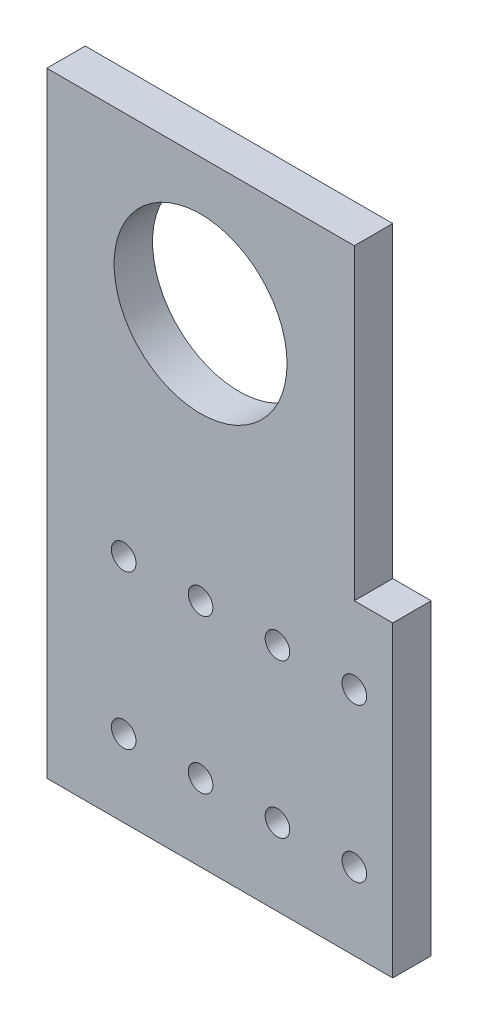
ISO-10303-21;
HEADER;
FILE_DESCRIPTION(('STEP AP214'),'2;1');
FILE_NAME('part.step','',(''),(''),'','','');
FILE_SCHEMA(('AUTOMOTIVE_DESIGN { 1 0 10303 214 1 1 1 1 }'));
ENDSEC;
DATA;
#1=APPLICATION_CONTEXT('core data for automotive mechanical design processes');
#2=APPLICATION_PROTOCOL_DEFINITION('international standard','automotive_design',2000,#1);
#3=PRODUCT_CONTEXT('',#1,'mechanical');
#4=PRODUCT('Part','Part','',(#3));
#5=PRODUCT_RELATED_PRODUCT_CATEGORY('part','',(#4));
#6=PRODUCT_DEFINITION_FORMATION('','',#4);
#7=PRODUCT_DEFINITION_CONTEXT('part definition',#1,'design');
#8=PRODUCT_DEFINITION('design','',#6,#7);
#9=PRODUCT_DEFINITION_SHAPE('','',#8);
#10=(LENGTH_UNIT() NAMED_UNIT(*) SI_UNIT(.MILLI.,.METRE.));
#11=(NAMED_UNIT(*) PLANE_ANGLE_UNIT() SI_UNIT($,.RADIAN.));
#12=(NAMED_UNIT(*) SI_UNIT($,.STERADIAN.) SOLID_ANGLE_UNIT());
#13=UNCERTAINTY_MEASURE_WITH_UNIT(LENGTH_MEASURE(1.E-05),#10,'distance_accuracy_value','');
#14=(GEOMETRIC_REPRESENTATION_CONTEXT(3) GLOBAL_UNCERTAINTY_ASSIGNED_CONTEXT((#13)) GLOBAL_UNIT_ASSIGNED_CONTEXT((#10,
#11,#12)) REPRESENTATION_CONTEXT('',''));
#15=CARTESIAN_POINT('',(0.,0.,0.));
#16=DIRECTION('',(0.,0.,1.));
#17=DIRECTION('',(1.,0.,0.));
#18=AXIS2_PLACEMENT_3D('',#15,#16,#17);
#19=CARTESIAN_POINT('',(-125.79203122036,-159.641560720638,6.35));
#20=DIRECTION('',(1.,0.,0.));
#21=DIRECTION('',(0.,0.,-1.));
#22=AXIS2_PLACEMENT_3D('',#19,#20,#21);
#23=PLANE('',#22);
#24=DIRECTION('',(0.,-1.,0.));
#25=VECTOR('',#24,1.);
#26=CARTESIAN_POINT('',(-125.79203122036,-159.641560720638,0.));
#27=LINE('',#26,#25);
#28=CARTESIAN_POINT('',(-125.79203122036,-58.0415607206385,0.));
#29=VERTEX_POINT('',#28);
#30=CARTESIAN_POINT('',(-125.79203122036,-159.641560720638,0.));
#31=VERTEX_POINT('',#30);
#32=EDGE_CURVE('E128',#29,#31,#27,.T.);
#33=ORIENTED_EDGE('',*,*,#32,.T.);
#34=DIRECTION('',(0.,0.,-1.));
#35=VECTOR('',#34,1.);
#36=CARTESIAN_POINT('',(-125.79203122036,-159.641560720638,6.35));
#37=LINE('',#36,#35);
#38=CARTESIAN_POINT('',(-125.79203122036,-159.641560720638,6.35));
#39=VERTEX_POINT('',#38);
#40=EDGE_CURVE('E11',#39,#31,#37,.T.);
#41=ORIENTED_EDGE('',*,*,#40,.F.);
#42=DIRECTION('',(0.,-1.,0.));
#43=VECTOR('',#42,1.);
#44=CARTESIAN_POINT('',(-125.79203122036,-159.641560720638,6.35));
#45=LINE('',#44,#43);
#46=CARTESIAN_POINT('',(-125.79203122036,-58.0415607206385,6.35));
#47=VERTEX_POINT('',#46);
#48=EDGE_CURVE('E145',#47,#39,#45,.T.);
#49=ORIENTED_EDGE('',*,*,#48,.F.);
#50=DIRECTION('',(0.,0.,-1.));
#51=VECTOR('',#50,1.);
#52=CARTESIAN_POINT('',(-125.79203122036,-58.0415607206385,6.35));
#53=LINE('',#52,#51);
#54=EDGE_CURVE('E124',#47,#29,#53,.T.);
#55=ORIENTED_EDGE('',*,*,#54,.T.);
#56=EDGE_LOOP('',(#33,#41,#49,#55));
#57=FACE_BOUND('',#56,.T.);
#58=ADVANCED_FACE('F39',(#57),#23,.F.);
#59=CARTESIAN_POINT('',(-74.9920312203596,-159.641560720638,6.35));
#60=DIRECTION('',(0.,1.,0.));
#61=DIRECTION('',(0.,0.,1.));
#62=AXIS2_PLACEMENT_3D('',#59,#60,#61);
#63=PLANE('',#62);
#64=DIRECTION('',(1.,0.,0.));
#65=VECTOR('',#64,1.);
#66=CARTESIAN_POINT('',(-74.9920312203596,-159.641560720638,0.));
#67=LINE('',#66,#65);
#68=CARTESIAN_POINT('',(-68.6420312203597,-159.641560720638,0.));
#69=VERTEX_POINT('',#68);
#70=EDGE_CURVE('E132',#31,#69,#67,.T.);
#71=ORIENTED_EDGE('',*,*,#70,.T.);
#72=DIRECTION('',(0.,0.,-1.));
#73=VECTOR('',#72,1.);
#74=CARTESIAN_POINT('',(-68.6420312203597,-159.641560720638,6.35));
#75=LINE('',#74,#73);
#76=CARTESIAN_POINT('',(-68.6420312203597,-159.641560720638,6.35));
#77=VERTEX_POINT('',#76);
#78=EDGE_CURVE('E48',#77,#69,#75,.T.);
#79=ORIENTED_EDGE('',*,*,#78,.F.);
#80=DIRECTION('',(1.,0.,0.));
#81=VECTOR('',#80,1.);
#82=CARTESIAN_POINT('',(-125.79203122036,-159.641560720638,6.35));
#83=LINE('',#82,#81);
#84=EDGE_CURVE('E93',#39,#77,#83,.T.);
#85=ORIENTED_EDGE('',*,*,#84,.F.);
#86=ORIENTED_EDGE('',*,*,#40,.T.);
#87=EDGE_LOOP('',(#71,#79,#85,#86));
#88=FACE_BOUND('',#87,.T.);
#89=ADVANCED_FACE('F174',(#88),#63,.F.);
#90=CARTESIAN_POINT('',(-68.6420312203597,-159.641560720638,6.35));
#91=DIRECTION('',(-1.,0.,0.));
#92=DIRECTION('',(0.,0.,1.));
#93=AXIS2_PLACEMENT_3D('',#90,#91,#92);
#94=PLANE('',#93);
#95=DIRECTION('',(0.,1.,0.));
#96=VECTOR('',#95,1.);
#97=CARTESIAN_POINT('',(-68.6420312203597,-159.641560720638,0.));
#98=LINE('',#97,#96);
#99=CARTESIAN_POINT('',(-68.6420312203597,-108.841560720638,0.));
#100=VERTEX_POINT('',#99);
#101=EDGE_CURVE('E136',#69,#100,#98,.T.);
#102=ORIENTED_EDGE('',*,*,#101,.T.);
#103=DIRECTION('',(0.,0.,-1.));
#104=VECTOR('',#103,1.);
#105=CARTESIAN_POINT('',(-68.6420312203597,-108.841560720638,6.35));
#106=LINE('',#105,#104);
#107=CARTESIAN_POINT('',(-68.6420312203597,-108.841560720638,6.35));
#108=VERTEX_POINT('',#107);
#109=EDGE_CURVE('E117',#108,#100,#106,.T.);
#110=ORIENTED_EDGE('',*,*,#109,.F.);
#111=DIRECTION('',(0.,1.,0.));
#112=VECTOR('',#111,1.);
#113=CARTESIAN_POINT('',(-68.6420312203597,-159.641560720638,6.35));
#114=LINE('',#113,#112);
#115=EDGE_CURVE('E106',#77,#108,#114,.T.);
#116=ORIENTED_EDGE('',*,*,#115,.F.);
#117=ORIENTED_EDGE('',*,*,#78,.T.);
#118=EDGE_LOOP('',(#102,#110,#116,#117));
#119=FACE_BOUND('',#118,.T.);
#120=ADVANCED_FACE('F155',(#119),#94,.F.);
#121=CARTESIAN_POINT('',(-68.6420312203597,-108.841560720638,6.35));
#122=DIRECTION('',(0.,-1.,0.));
#123=DIRECTION('',(0.,0.,-1.));
#124=AXIS2_PLACEMENT_3D('',#121,#122,#123);
#125=PLANE('',#124);
#126=DIRECTION('',(-1.,0.,0.));
#127=VECTOR('',#126,1.);
#128=CARTESIAN_POINT('',(-68.6420312203597,-108.841560720638,0.));
#129=LINE('',#128,#127);
#130=CARTESIAN_POINT('',(-74.9920312203596,-108.841560720638,0.));
#131=VERTEX_POINT('',#130);
#132=EDGE_CURVE('E115',#100,#131,#129,.T.);
#133=ORIENTED_EDGE('',*,*,#132,.T.);
#134=DIRECTION('',(0.,0.,-1.));
#135=VECTOR('',#134,1.);
#136=CARTESIAN_POINT('',(-74.9920312203596,-108.841560720638,6.35));
#137=LINE('',#136,#135);
#138=CARTESIAN_POINT('',(-74.9920312203596,-108.841560720638,6.35));
#139=VERTEX_POINT('',#138);
#140=EDGE_CURVE('E112',#139,#131,#137,.T.);
#141=ORIENTED_EDGE('',*,*,#140,.F.);
#142=DIRECTION('',(-1.,0.,0.));
#143=VECTOR('',#142,1.);
#144=CARTESIAN_POINT('',(-68.6420312203597,-108.841560720638,6.35));
#145=LINE('',#144,#143);
#146=EDGE_CURVE('E100',#108,#139,#145,.T.);
#147=ORIENTED_EDGE('',*,*,#146,.F.);
#148=ORIENTED_EDGE('',*,*,#109,.T.);
#149=EDGE_LOOP('',(#133,#141,#147,#148));
#150=FACE_BOUND('',#149,.T.);
#151=ADVANCED_FACE('F113',(#150),#125,.F.);
#152=CARTESIAN_POINT('',(-74.9920312203596,-58.0415607206385,6.35));
#153=DIRECTION('',(-1.,0.,0.));
#154=DIRECTION('',(0.,0.,1.));
#155=AXIS2_PLACEMENT_3D('',#152,#153,#154);
#156=PLANE('',#155);
#157=DIRECTION('',(0.,1.,0.));
#158=VECTOR('',#157,1.);
#159=CARTESIAN_POINT('',(-74.9920312203596,-58.0415607206385,0.));
#160=LINE('',#159,#158);
#161=CARTESIAN_POINT('',(-74.9920312203596,-58.0415607206385,0.));
#162=VERTEX_POINT('',#161);
#163=EDGE_CURVE('E79',#131,#162,#160,.T.);
#164=ORIENTED_EDGE('',*,*,#163,.T.);
#165=DIRECTION('',(0.,0.,-1.));
#166=VECTOR('',#165,1.);
#167=CARTESIAN_POINT('',(-74.9920312203596,-58.0415607206385,6.35));
#168=LINE('',#167,#166);
#169=CARTESIAN_POINT('',(-74.9920312203596,-58.0415607206385,6.35));
#170=VERTEX_POINT('',#169);
#171=EDGE_CURVE('E118',#170,#162,#168,.T.);
#172=ORIENTED_EDGE('',*,*,#171,.F.);
#173=DIRECTION('',(0.,1.,0.));
#174=VECTOR('',#173,1.);
#175=CARTESIAN_POINT('',(-74.9920312203596,-58.0415607206385,6.35));
#176=LINE('',#175,#174);
#177=EDGE_CURVE('E104',#139,#170,#176,.T.);
#178=ORIENTED_EDGE('',*,*,#177,.F.);
#179=ORIENTED_EDGE('',*,*,#140,.T.);
#180=EDGE_LOOP('',(#164,#172,#178,#179));
#181=FACE_BOUND('',#180,.T.);
#182=ADVANCED_FACE('F120',(#181),#156,.F.);
#183=CARTESIAN_POINT('',(-125.79203122036,-58.0415607206385,6.35));
#184=DIRECTION('',(0.,-1.,0.));
#185=DIRECTION('',(0.,0.,-1.));
#186=AXIS2_PLACEMENT_3D('',#183,#184,#185);
#187=PLANE('',#186);
#188=DIRECTION('',(-1.,0.,0.));
#189=VECTOR('',#188,1.);
#190=CARTESIAN_POINT('',(-125.79203122036,-58.0415607206385,0.));
#191=LINE('',#190,#189);
#192=EDGE_CURVE('E85',#162,#29,#191,.T.);
#193=ORIENTED_EDGE('',*,*,#192,.T.);
#194=ORIENTED_EDGE('',*,*,#54,.F.);
#195=DIRECTION('',(-1.,0.,0.));
#196=VECTOR('',#195,1.);
#197=CARTESIAN_POINT('',(-125.79203122036,-58.0415607206385,6.35));
#198=LINE('',#197,#196);
#199=EDGE_CURVE('E56',#170,#47,#198,.T.);
#200=ORIENTED_EDGE('',*,*,#199,.F.);
#201=ORIENTED_EDGE('',*,*,#171,.T.);
#202=EDGE_LOOP('',(#193,#194,#200,#201));
#203=FACE_BOUND('',#202,.T.);
#204=ADVANCED_FACE('F162',(#203),#187,.F.);
#205=CARTESIAN_POINT('',(0.,0.,6.35));
#206=DIRECTION('',(0.,0.,-1.));
#207=DIRECTION('',(-1.,0.,0.));
#208=AXIS2_PLACEMENT_3D('',#205,#206,#207);
#209=PLANE('',#208);
#210=CARTESIAN_POINT('',(-100.39203122036,-80.4837880146609,6.35));
#211=DIRECTION('',(0.,0.,1.));
#212=DIRECTION('',(1.,0.,0.));
#213=AXIS2_PLACEMENT_3D('',#210,#211,#212);
#214=CIRCLE('',#213,14.2875);
#215=CARTESIAN_POINT('',(-86.1045312203597,-80.4837880146609,6.35));
#216=VERTEX_POINT('',#215);
#217=EDGE_CURVE('E309',#216,#216,#214,.T.);
#218=ORIENTED_EDGE('',*,*,#217,.F.);
#219=EDGE_LOOP('',(#218));
#220=FACE_BOUND('',#219,.T.);
#221=CARTESIAN_POINT('',(-100.39203122036,-121.541560720638,6.35));
#222=DIRECTION('',(0.,0.,1.));
#223=DIRECTION('',(1.,0.,0.));
#224=AXIS2_PLACEMENT_3D('',#221,#222,#223);
#225=CIRCLE('',#224,2.03200000000001);
#226=CARTESIAN_POINT('',(-98.3600312203596,-121.541560720638,6.35));
#227=VERTEX_POINT('',#226);
#228=EDGE_CURVE('E349',#227,#227,#225,.T.);
#229=ORIENTED_EDGE('',*,*,#228,.F.);
#230=EDGE_LOOP('',(#229));
#231=FACE_BOUND('',#230,.T.);
#232=CARTESIAN_POINT('',(-74.9920312203596,-121.541560720638,6.35));
#233=DIRECTION('',(0.,0.,1.));
#234=DIRECTION('',(1.,0.,0.));
#235=AXIS2_PLACEMENT_3D('',#232,#233,#234);
#236=CIRCLE('',#235,2.03200000000001);
#237=CARTESIAN_POINT('',(-72.9600312203596,-121.541560720638,6.35));
#238=VERTEX_POINT('',#237);
#239=EDGE_CURVE('E341',#238,#238,#236,.T.);
#240=ORIENTED_EDGE('',*,*,#239,.F.);
#241=EDGE_LOOP('',(#240));
#242=FACE_BOUND('',#241,.T.);
#243=CARTESIAN_POINT('',(-100.39203122036,-146.941560720639,6.35));
#244=DIRECTION('',(0.,0.,1.));
#245=DIRECTION('',(1.,0.,0.));
#246=AXIS2_PLACEMENT_3D('',#243,#244,#245);
#247=CIRCLE('',#246,2.032);
#248=CARTESIAN_POINT('',(-98.3600312203596,-146.941560720639,6.35));
#249=VERTEX_POINT('',#248);
#250=EDGE_CURVE('E333',#249,#249,#247,.T.);
#251=ORIENTED_EDGE('',*,*,#250,.F.);
#252=EDGE_LOOP('',(#251));
#253=FACE_BOUND('',#252,.T.);
#254=CARTESIAN_POINT('',(-113.09203122036,-146.941560720639,6.35));
#255=DIRECTION('',(0.,0.,1.));
#256=DIRECTION('',(1.,0.,0.));
#257=AXIS2_PLACEMENT_3D('',#254,#255,#256);
#258=CIRCLE('',#257,2.032);
#259=CARTESIAN_POINT('',(-111.06003122036,-146.941560720639,6.35));
#260=VERTEX_POINT('',#259);
#261=EDGE_CURVE('E325',#260,#260,#258,.T.);
#262=ORIENTED_EDGE('',*,*,#261,.F.);
#263=EDGE_LOOP('',(#262));
#264=FACE_BOUND('',#263,.T.);
#265=CARTESIAN_POINT('',(-74.9920312203596,-146.941560720639,6.35));
#266=DIRECTION('',(0.,0.,1.));
#267=DIRECTION('',(1.,0.,0.));
#268=AXIS2_PLACEMENT_3D('',#265,#266,#267);
#269=CIRCLE('',#268,2.032);
#270=CARTESIAN_POINT('',(-72.9600312203596,-146.941560720639,6.35));
#271=VERTEX_POINT('',#270);
#272=EDGE_CURVE('E317',#271,#271,#269,.T.);
#273=ORIENTED_EDGE('',*,*,#272,.F.);
#274=EDGE_LOOP('',(#273));
#275=FACE_BOUND('',#274,.T.);
#276=CARTESIAN_POINT('',(-113.09203122036,-121.541560720638,6.35));
#277=DIRECTION('',(0.,0.,1.));
#278=DIRECTION('',(1.,0.,0.));
#279=AXIS2_PLACEMENT_3D('',#276,#277,#278);
#280=CIRCLE('',#279,2.03200000000001);
#281=CARTESIAN_POINT('',(-111.06003122036,-121.541560720638,6.35));
#282=VERTEX_POINT('',#281);
#283=EDGE_CURVE('E357',#282,#282,#280,.T.);
#284=ORIENTED_EDGE('',*,*,#283,.F.);
#285=EDGE_LOOP('',(#284));
#286=FACE_BOUND('',#285,.T.);
#287=CARTESIAN_POINT('',(-87.6920312203597,-146.941560720639,6.35));
#288=DIRECTION('',(0.,0.,1.));
#289=DIRECTION('',(1.,0.,0.));
#290=AXIS2_PLACEMENT_3D('',#287,#288,#289);
#291=CIRCLE('',#290,2.032);
#292=CARTESIAN_POINT('',(-85.6600312203596,-146.941560720639,6.35));
#293=VERTEX_POINT('',#292);
#294=EDGE_CURVE('E358',#293,#293,#291,.T.);
#295=ORIENTED_EDGE('',*,*,#294,.F.);
#296=EDGE_LOOP('',(#295));
#297=FACE_BOUND('',#296,.T.);
#298=CARTESIAN_POINT('',(-87.6920312203597,-121.541560720638,6.35));
#299=DIRECTION('',(0.,0.,1.));
#300=DIRECTION('',(1.,0.,0.));
#301=AXIS2_PLACEMENT_3D('',#298,#299,#300);
#302=CIRCLE('',#301,2.03200000000001);
#303=CARTESIAN_POINT('',(-85.6600312203596,-121.541560720638,6.35));
#304=VERTEX_POINT('',#303);
#305=EDGE_CURVE('E324',#304,#304,#302,.T.);
#306=ORIENTED_EDGE('',*,*,#305,.F.);
#307=EDGE_LOOP('',(#306));
#308=FACE_BOUND('',#307,.T.);
#309=ORIENTED_EDGE('',*,*,#48,.T.);
#310=ORIENTED_EDGE('',*,*,#84,.T.);
#311=ORIENTED_EDGE('',*,*,#115,.T.);
#312=ORIENTED_EDGE('',*,*,#146,.T.);
#313=ORIENTED_EDGE('',*,*,#177,.T.);
#314=ORIENTED_EDGE('',*,*,#199,.T.);
#315=EDGE_LOOP('',(#309,#310,#311,#312,#313,#314));
#316=FACE_BOUND('',#315,.T.);
#317=ADVANCED_FACE('F102',(#220,#231,#242,#253,#264,#275,#286,#297,#308,#316),#209,.F.);
#318=CARTESIAN_POINT('',(0.,0.,0.));
#319=DIRECTION('',(0.,0.,-1.));
#320=DIRECTION('',(-1.,0.,0.));
#321=AXIS2_PLACEMENT_3D('',#318,#319,#320);
#322=PLANE('',#321);
#323=CARTESIAN_POINT('',(-100.39203122036,-80.4837880146609,0.));
#324=DIRECTION('',(0.,0.,1.));
#325=DIRECTION('',(1.,0.,0.));
#326=AXIS2_PLACEMENT_3D('',#323,#324,#325);
#327=CIRCLE('',#326,14.2875);
#328=CARTESIAN_POINT('',(-86.1045312203597,-80.4837880146609,0.));
#329=VERTEX_POINT('',#328);
#330=EDGE_CURVE('E133',#329,#329,#327,.T.);
#331=ORIENTED_EDGE('',*,*,#330,.T.);
#332=EDGE_LOOP('',(#331));
#333=FACE_BOUND('',#332,.T.);
#334=CARTESIAN_POINT('',(-100.39203122036,-121.541560720638,0.));
#335=DIRECTION('',(0.,0.,1.));
#336=DIRECTION('',(1.,0.,0.));
#337=AXIS2_PLACEMENT_3D('',#334,#335,#336);
#338=CIRCLE('',#337,2.03200000000001);
#339=CARTESIAN_POINT('',(-98.3600312203596,-121.541560720638,0.));
#340=VERTEX_POINT('',#339);
#341=EDGE_CURVE('E345',#340,#340,#338,.T.);
#342=ORIENTED_EDGE('',*,*,#341,.T.);
#343=EDGE_LOOP('',(#342));
#344=FACE_BOUND('',#343,.T.);
#345=CARTESIAN_POINT('',(-74.9920312203596,-121.541560720638,0.));
#346=DIRECTION('',(0.,0.,1.));
#347=DIRECTION('',(1.,0.,0.));
#348=AXIS2_PLACEMENT_3D('',#345,#346,#347);
#349=CIRCLE('',#348,2.03200000000001);
#350=CARTESIAN_POINT('',(-72.9600312203596,-121.541560720638,0.));
#351=VERTEX_POINT('',#350);
#352=EDGE_CURVE('E337',#351,#351,#349,.T.);
#353=ORIENTED_EDGE('',*,*,#352,.T.);
#354=EDGE_LOOP('',(#353));
#355=FACE_BOUND('',#354,.T.);
#356=CARTESIAN_POINT('',(-100.39203122036,-146.941560720639,0.));
#357=DIRECTION('',(0.,0.,1.));
#358=DIRECTION('',(1.,0.,0.));
#359=AXIS2_PLACEMENT_3D('',#356,#357,#358);
#360=CIRCLE('',#359,2.032);
#361=CARTESIAN_POINT('',(-98.3600312203596,-146.941560720639,0.));
#362=VERTEX_POINT('',#361);
#363=EDGE_CURVE('E329',#362,#362,#360,.T.);
#364=ORIENTED_EDGE('',*,*,#363,.T.);
#365=EDGE_LOOP('',(#364));
#366=FACE_BOUND('',#365,.T.);
#367=CARTESIAN_POINT('',(-113.09203122036,-146.941560720639,0.));
#368=DIRECTION('',(0.,0.,1.));
#369=DIRECTION('',(1.,0.,0.));
#370=AXIS2_PLACEMENT_3D('',#367,#368,#369);
#371=CIRCLE('',#370,2.032);
#372=CARTESIAN_POINT('',(-111.06003122036,-146.941560720639,0.));
#373=VERTEX_POINT('',#372);
#374=EDGE_CURVE('E320',#373,#373,#371,.T.);
#375=ORIENTED_EDGE('',*,*,#374,.T.);
#376=EDGE_LOOP('',(#375));
#377=FACE_BOUND('',#376,.T.);
#378=CARTESIAN_POINT('',(-74.9920312203596,-146.941560720639,0.));
#379=DIRECTION('',(0.,0.,1.));
#380=DIRECTION('',(1.,0.,0.));
#381=AXIS2_PLACEMENT_3D('',#378,#379,#380);
#382=CIRCLE('',#381,2.032);
#383=CARTESIAN_POINT('',(-72.9600312203596,-146.941560720639,0.));
#384=VERTEX_POINT('',#383);
#385=EDGE_CURVE('E311',#384,#384,#382,.T.);
#386=ORIENTED_EDGE('',*,*,#385,.T.);
#387=EDGE_LOOP('',(#386));
#388=FACE_BOUND('',#387,.T.);
#389=CARTESIAN_POINT('',(-113.09203122036,-121.541560720638,0.));
#390=DIRECTION('',(0.,0.,1.));
#391=DIRECTION('',(1.,0.,0.));
#392=AXIS2_PLACEMENT_3D('',#389,#390,#391);
#393=CIRCLE('',#392,2.03200000000001);
#394=CARTESIAN_POINT('',(-111.06003122036,-121.541560720638,0.));
#395=VERTEX_POINT('',#394);
#396=EDGE_CURVE('E372',#395,#395,#393,.T.);
#397=ORIENTED_EDGE('',*,*,#396,.T.);
#398=EDGE_LOOP('',(#397));
#399=FACE_BOUND('',#398,.T.);
#400=CARTESIAN_POINT('',(-87.6920312203597,-146.941560720639,0.));
#401=DIRECTION('',(0.,0.,1.));
#402=DIRECTION('',(1.,0.,0.));
#403=AXIS2_PLACEMENT_3D('',#400,#401,#402);
#404=CIRCLE('',#403,2.032);
#405=CARTESIAN_POINT('',(-85.6600312203596,-146.941560720639,0.));
#406=VERTEX_POINT('',#405);
#407=EDGE_CURVE('E353',#406,#406,#404,.T.);
#408=ORIENTED_EDGE('',*,*,#407,.T.);
#409=EDGE_LOOP('',(#408));
#410=FACE_BOUND('',#409,.T.);
#411=CARTESIAN_POINT('',(-87.6920312203597,-121.541560720638,0.));
#412=DIRECTION('',(0.,0.,1.));
#413=DIRECTION('',(1.,0.,0.));
#414=AXIS2_PLACEMENT_3D('',#411,#412,#413);
#415=CIRCLE('',#414,2.03200000000001);
#416=CARTESIAN_POINT('',(-85.6600312203596,-121.541560720638,0.));
#417=VERTEX_POINT('',#416);
#418=EDGE_CURVE('E362',#417,#417,#415,.T.);
#419=ORIENTED_EDGE('',*,*,#418,.T.);
#420=EDGE_LOOP('',(#419));
#421=FACE_BOUND('',#420,.T.);
#422=ORIENTED_EDGE('',*,*,#32,.F.);
#423=ORIENTED_EDGE('',*,*,#192,.F.);
#424=ORIENTED_EDGE('',*,*,#163,.F.);
#425=ORIENTED_EDGE('',*,*,#132,.F.);
#426=ORIENTED_EDGE('',*,*,#101,.F.);
#427=ORIENTED_EDGE('',*,*,#70,.F.);
#428=EDGE_LOOP('',(#422,#423,#424,#425,#426,#427));
#429=FACE_BOUND('',#428,.T.);
#430=ADVANCED_FACE('F158',(#333,#344,#355,#366,#377,#388,#399,#410,#421,#429),#322,.T.);
#431=CARTESIAN_POINT('',(-87.6920312203597,-121.541560720638,0.));
#432=DIRECTION('',(0.,0.,1.));
#433=DIRECTION('',(1.,0.,0.));
#434=AXIS2_PLACEMENT_3D('',#431,#432,#433);
#435=CYLINDRICAL_SURFACE('',#434,2.03200000000001);
#436=ORIENTED_EDGE('',*,*,#418,.F.);
#437=EDGE_LOOP('',(#436));
#438=FACE_BOUND('',#437,.T.);
#439=ORIENTED_EDGE('',*,*,#305,.T.);
#440=EDGE_LOOP('',(#439));
#441=FACE_BOUND('',#440,.T.);
#442=ADVANCED_FACE('F211',(#438,#441),#435,.F.);
#443=CARTESIAN_POINT('',(-87.6920312203597,-146.941560720639,0.));
#444=DIRECTION('',(0.,0.,1.));
#445=DIRECTION('',(1.,0.,0.));
#446=AXIS2_PLACEMENT_3D('',#443,#444,#445);
#447=CYLINDRICAL_SURFACE('',#446,2.032);
#448=ORIENTED_EDGE('',*,*,#407,.F.);
#449=EDGE_LOOP('',(#448));
#450=FACE_BOUND('',#449,.T.);
#451=ORIENTED_EDGE('',*,*,#294,.T.);
#452=EDGE_LOOP('',(#451));
#453=FACE_BOUND('',#452,.T.);
#454=ADVANCED_FACE('F220',(#450,#453),#447,.F.);
#455=CARTESIAN_POINT('',(-113.09203122036,-121.541560720638,0.));
#456=DIRECTION('',(0.,0.,1.));
#457=DIRECTION('',(1.,0.,0.));
#458=AXIS2_PLACEMENT_3D('',#455,#456,#457);
#459=CYLINDRICAL_SURFACE('',#458,2.03200000000001);
#460=ORIENTED_EDGE('',*,*,#396,.F.);
#461=EDGE_LOOP('',(#460));
#462=FACE_BOUND('',#461,.T.);
#463=ORIENTED_EDGE('',*,*,#283,.T.);
#464=EDGE_LOOP('',(#463));
#465=FACE_BOUND('',#464,.T.);
#466=ADVANCED_FACE('F230',(#462,#465),#459,.F.);
#467=CARTESIAN_POINT('',(-74.9920312203596,-146.941560720639,0.));
#468=DIRECTION('',(0.,0.,1.));
#469=DIRECTION('',(1.,0.,0.));
#470=AXIS2_PLACEMENT_3D('',#467,#468,#469);
#471=CYLINDRICAL_SURFACE('',#470,2.032);
#472=ORIENTED_EDGE('',*,*,#385,.F.);
#473=EDGE_LOOP('',(#472));
#474=FACE_BOUND('',#473,.T.);
#475=ORIENTED_EDGE('',*,*,#272,.T.);
#476=EDGE_LOOP('',(#475));
#477=FACE_BOUND('',#476,.T.);
#478=ADVANCED_FACE('F240',(#474,#477),#471,.F.);
#479=CARTESIAN_POINT('',(-113.09203122036,-146.941560720639,0.));
#480=DIRECTION('',(0.,0.,1.));
#481=DIRECTION('',(1.,0.,0.));
#482=AXIS2_PLACEMENT_3D('',#479,#480,#481);
#483=CYLINDRICAL_SURFACE('',#482,2.032);
#484=ORIENTED_EDGE('',*,*,#374,.F.);
#485=EDGE_LOOP('',(#484));
#486=FACE_BOUND('',#485,.T.);
#487=ORIENTED_EDGE('',*,*,#261,.T.);
#488=EDGE_LOOP('',(#487));
#489=FACE_BOUND('',#488,.T.);
#490=ADVANCED_FACE('F250',(#486,#489),#483,.F.);
#491=CARTESIAN_POINT('',(-100.39203122036,-146.941560720639,0.));
#492=DIRECTION('',(0.,0.,1.));
#493=DIRECTION('',(1.,0.,0.));
#494=AXIS2_PLACEMENT_3D('',#491,#492,#493);
#495=CYLINDRICAL_SURFACE('',#494,2.032);
#496=ORIENTED_EDGE('',*,*,#363,.F.);
#497=EDGE_LOOP('',(#496));
#498=FACE_BOUND('',#497,.T.);
#499=ORIENTED_EDGE('',*,*,#250,.T.);
#500=EDGE_LOOP('',(#499));
#501=FACE_BOUND('',#500,.T.);
#502=ADVANCED_FACE('F260',(#498,#501),#495,.F.);
#503=CARTESIAN_POINT('',(-74.9920312203596,-121.541560720638,0.));
#504=DIRECTION('',(0.,0.,1.));
#505=DIRECTION('',(1.,0.,0.));
#506=AXIS2_PLACEMENT_3D('',#503,#504,#505);
#507=CYLINDRICAL_SURFACE('',#506,2.03200000000001);
#508=ORIENTED_EDGE('',*,*,#352,.F.);
#509=EDGE_LOOP('',(#508));
#510=FACE_BOUND('',#509,.T.);
#511=ORIENTED_EDGE('',*,*,#239,.T.);
#512=EDGE_LOOP('',(#511));
#513=FACE_BOUND('',#512,.T.);
#514=ADVANCED_FACE('F270',(#510,#513),#507,.F.);
#515=CARTESIAN_POINT('',(-100.39203122036,-121.541560720638,0.));
#516=DIRECTION('',(0.,0.,1.));
#517=DIRECTION('',(1.,0.,0.));
#518=AXIS2_PLACEMENT_3D('',#515,#516,#517);
#519=CYLINDRICAL_SURFACE('',#518,2.03200000000001);
#520=ORIENTED_EDGE('',*,*,#341,.F.);
#521=EDGE_LOOP('',(#520));
#522=FACE_BOUND('',#521,.T.);
#523=ORIENTED_EDGE('',*,*,#228,.T.);
#524=EDGE_LOOP('',(#523));
#525=FACE_BOUND('',#524,.T.);
#526=ADVANCED_FACE('F280',(#522,#525),#519,.F.);
#527=CARTESIAN_POINT('',(-100.39203122036,-80.4837880146609,0.));
#528=DIRECTION('',(0.,0.,1.));
#529=DIRECTION('',(1.,0.,0.));
#530=AXIS2_PLACEMENT_3D('',#527,#528,#529);
#531=CYLINDRICAL_SURFACE('',#530,14.2875);
#532=ORIENTED_EDGE('',*,*,#330,.F.);
#533=EDGE_LOOP('',(#532));
#534=FACE_BOUND('',#533,.T.);
#535=ORIENTED_EDGE('',*,*,#217,.T.);
#536=EDGE_LOOP('',(#535));
#537=FACE_BOUND('',#536,.T.);
#538=ADVANCED_FACE('F290',(#534,#537),#531,.F.);
#539=CLOSED_SHELL('',(#58,#89,#120,#151,#182,#204,#317,#430,#442,#454,#466,#478,#490,#502,#514,
#526,#538));
#540=MANIFOLD_SOLID_BREP('B2',#539);
#541=ADVANCED_BREP_SHAPE_REPRESENTATION('',(#18,#540),#14);
#542=SHAPE_DEFINITION_REPRESENTATION(#9,#541);
ENDSEC;
END-ISO-10303-21;
